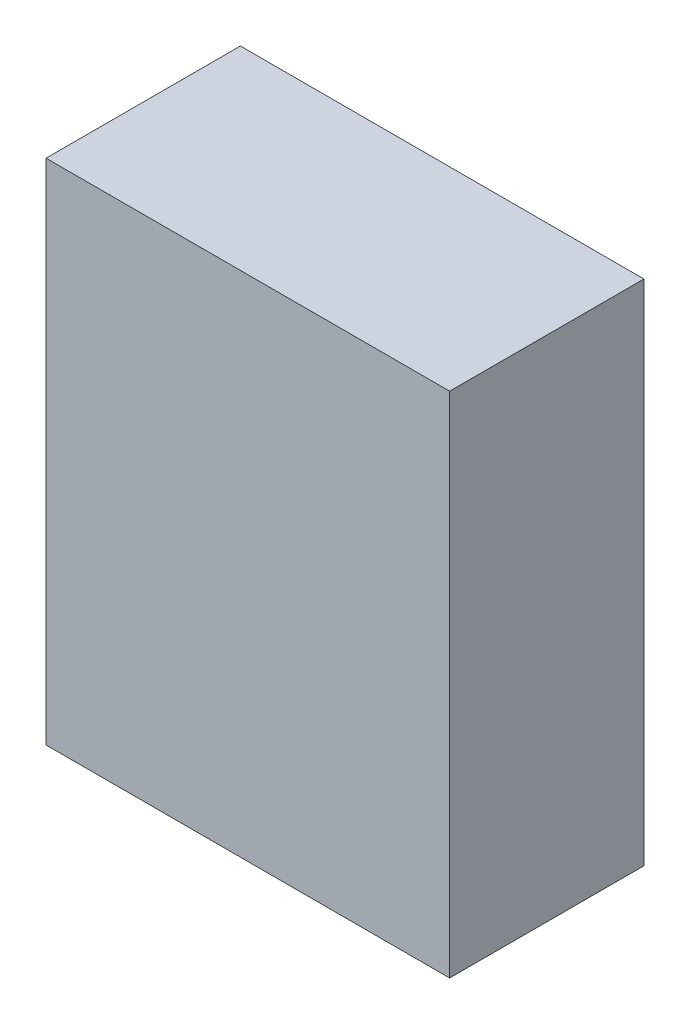
ISO-10303-21;
HEADER;
FILE_DESCRIPTION(('STEP AP214'),'2;1');
FILE_NAME('part.step','',(''),(''),'','','');
FILE_SCHEMA(('AUTOMOTIVE_DESIGN { 1 0 10303 214 1 1 1 1 }'));
ENDSEC;
DATA;
#1=APPLICATION_CONTEXT('core data for automotive mechanical design processes');
#2=APPLICATION_PROTOCOL_DEFINITION('international standard','automotive_design',2000,#1);
#3=PRODUCT_CONTEXT('',#1,'mechanical');
#4=PRODUCT('Part','Part','',(#3));
#5=PRODUCT_RELATED_PRODUCT_CATEGORY('part','',(#4));
#6=PRODUCT_DEFINITION_FORMATION('','',#4);
#7=PRODUCT_DEFINITION_CONTEXT('part definition',#1,'design');
#8=PRODUCT_DEFINITION('design','',#6,#7);
#9=PRODUCT_DEFINITION_SHAPE('','',#8);
#10=(LENGTH_UNIT() NAMED_UNIT(*) SI_UNIT(.MILLI.,.METRE.));
#11=(NAMED_UNIT(*) PLANE_ANGLE_UNIT() SI_UNIT($,.RADIAN.));
#12=(NAMED_UNIT(*) SI_UNIT($,.STERADIAN.) SOLID_ANGLE_UNIT());
#13=UNCERTAINTY_MEASURE_WITH_UNIT(LENGTH_MEASURE(1.E-05),#10,'distance_accuracy_value','');
#14=(GEOMETRIC_REPRESENTATION_CONTEXT(3) GLOBAL_UNCERTAINTY_ASSIGNED_CONTEXT((#13)) GLOBAL_UNIT_ASSIGNED_CONTEXT((#10,
#11,#12)) REPRESENTATION_CONTEXT('',''));
#15=CARTESIAN_POINT('',(0.,0.,0.));
#16=DIRECTION('',(0.,0.,1.));
#17=DIRECTION('',(1.,0.,0.));
#18=AXIS2_PLACEMENT_3D('',#15,#16,#17);
#19=CARTESIAN_POINT('',(-1.34999984,-1.69999914,1.29999994));
#20=DIRECTION('',(0.,0.,1.));
#21=DIRECTION('',(1.,0.,0.));
#22=AXIS2_PLACEMENT_3D('',#19,#20,#21);
#23=PLANE('',#22);
#24=DIRECTION('',(1.,0.,0.));
#25=VECTOR('',#24,1.);
#26=CARTESIAN_POINT('',(-1.34999984,1.69999914,1.29999994));
#27=LINE('',#26,#25);
#28=CARTESIAN_POINT('',(-1.34999984,1.69999914,1.29999994));
#29=VERTEX_POINT('',#28);
#30=CARTESIAN_POINT('',(1.34999984,1.69999914,1.29999994));
#31=VERTEX_POINT('',#30);
#32=EDGE_CURVE('E53',#29,#31,#27,.T.);
#33=ORIENTED_EDGE('',*,*,#32,.F.);
#34=DIRECTION('',(0.,1.,0.));
#35=VECTOR('',#34,1.);
#36=CARTESIAN_POINT('',(-1.34999984,-1.69999914,1.29999994));
#37=LINE('',#36,#35);
#38=CARTESIAN_POINT('',(-1.34999984,-1.69999914,1.29999994));
#39=VERTEX_POINT('',#38);
#40=EDGE_CURVE('E68',#39,#29,#37,.T.);
#41=ORIENTED_EDGE('',*,*,#40,.F.);
#42=DIRECTION('',(1.,0.,0.));
#43=VECTOR('',#42,1.);
#44=CARTESIAN_POINT('',(1.34999984,-1.69999914,1.29999994));
#45=LINE('',#44,#43);
#46=CARTESIAN_POINT('',(1.34999984,-1.69999914,1.29999994));
#47=VERTEX_POINT('',#46);
#48=EDGE_CURVE('E20',#47,#39,#45,.F.);
#49=ORIENTED_EDGE('',*,*,#48,.F.);
#50=DIRECTION('',(0.,1.,0.));
#51=VECTOR('',#50,1.);
#52=CARTESIAN_POINT('',(1.34999984,1.69999914,1.29999994));
#53=LINE('',#52,#51);
#54=EDGE_CURVE('E58',#31,#47,#53,.F.);
#55=ORIENTED_EDGE('',*,*,#54,.F.);
#56=EDGE_LOOP('',(#33,#41,#49,#55));
#57=FACE_BOUND('',#56,.T.);
#58=ADVANCED_FACE('F17',(#57),#23,.T.);
#59=CARTESIAN_POINT('',(1.34999984,-1.69999914,0.));
#60=DIRECTION('',(0.,-1.,0.));
#61=DIRECTION('',(0.,0.,-1.));
#62=AXIS2_PLACEMENT_3D('',#59,#60,#61);
#63=PLANE('',#62);
#64=DIRECTION('',(0.,0.,1.));
#65=VECTOR('',#64,1.);
#66=CARTESIAN_POINT('',(-1.34999984,-1.69999914,0.));
#67=LINE('',#66,#65);
#68=CARTESIAN_POINT('',(-1.34999984,-1.69999914,0.));
#69=VERTEX_POINT('',#68);
#70=EDGE_CURVE('E79',#69,#39,#67,.T.);
#71=ORIENTED_EDGE('',*,*,#70,.F.);
#72=DIRECTION('',(1.,0.,0.));
#73=VECTOR('',#72,1.);
#74=CARTESIAN_POINT('',(-1.34999984,-1.69999914,0.));
#75=LINE('',#74,#73);
#76=CARTESIAN_POINT('',(1.34999984,-1.69999914,0.));
#77=VERTEX_POINT('',#76);
#78=EDGE_CURVE('E74',#69,#77,#75,.T.);
#79=ORIENTED_EDGE('',*,*,#78,.T.);
#80=DIRECTION('',(0.,0.,-1.));
#81=VECTOR('',#80,1.);
#82=CARTESIAN_POINT('',(1.34999984,-1.69999914,0.));
#83=LINE('',#82,#81);
#84=EDGE_CURVE('E63',#47,#77,#83,.T.);
#85=ORIENTED_EDGE('',*,*,#84,.F.);
#86=ORIENTED_EDGE('',*,*,#48,.T.);
#87=EDGE_LOOP('',(#71,#79,#85,#86));
#88=FACE_BOUND('',#87,.T.);
#89=ADVANCED_FACE('F73',(#88),#63,.T.);
#90=CARTESIAN_POINT('',(1.34999984,1.69999914,0.));
#91=DIRECTION('',(1.,0.,0.));
#92=DIRECTION('',(0.,0.,-1.));
#93=AXIS2_PLACEMENT_3D('',#90,#91,#92);
#94=PLANE('',#93);
#95=ORIENTED_EDGE('',*,*,#84,.T.);
#96=DIRECTION('',(0.,1.,0.));
#97=VECTOR('',#96,1.);
#98=CARTESIAN_POINT('',(1.34999984,-1.69999914,0.));
#99=LINE('',#98,#97);
#100=CARTESIAN_POINT('',(1.34999984,1.69999914,0.));
#101=VERTEX_POINT('',#100);
#102=EDGE_CURVE('E84',#77,#101,#99,.T.);
#103=ORIENTED_EDGE('',*,*,#102,.T.);
#104=DIRECTION('',(0.,0.,1.));
#105=VECTOR('',#104,1.);
#106=CARTESIAN_POINT('',(1.34999984,1.69999914,0.));
#107=LINE('',#106,#105);
#108=EDGE_CURVE('E65',#31,#101,#107,.F.);
#109=ORIENTED_EDGE('',*,*,#108,.F.);
#110=ORIENTED_EDGE('',*,*,#54,.T.);
#111=EDGE_LOOP('',(#95,#103,#109,#110));
#112=FACE_BOUND('',#111,.T.);
#113=ADVANCED_FACE('F60',(#112),#94,.T.);
#114=CARTESIAN_POINT('',(-1.34999984,1.69999914,0.));
#115=DIRECTION('',(0.,1.,0.));
#116=DIRECTION('',(0.,0.,1.));
#117=AXIS2_PLACEMENT_3D('',#114,#115,#116);
#118=PLANE('',#117);
#119=ORIENTED_EDGE('',*,*,#108,.T.);
#120=DIRECTION('',(1.,0.,0.));
#121=VECTOR('',#120,1.);
#122=CARTESIAN_POINT('',(-1.34999984,1.69999914,0.));
#123=LINE('',#122,#121);
#124=CARTESIAN_POINT('',(-1.34999984,1.69999914,0.));
#125=VERTEX_POINT('',#124);
#126=EDGE_CURVE('E26',#101,#125,#123,.F.);
#127=ORIENTED_EDGE('',*,*,#126,.T.);
#128=DIRECTION('',(0.,0.,1.));
#129=VECTOR('',#128,1.);
#130=CARTESIAN_POINT('',(-1.34999984,1.69999914,0.));
#131=LINE('',#130,#129);
#132=EDGE_CURVE('E34',#29,#125,#131,.F.);
#133=ORIENTED_EDGE('',*,*,#132,.F.);
#134=ORIENTED_EDGE('',*,*,#32,.T.);
#135=EDGE_LOOP('',(#119,#127,#133,#134));
#136=FACE_BOUND('',#135,.T.);
#137=ADVANCED_FACE('F88',(#136),#118,.T.);
#138=CARTESIAN_POINT('',(-1.34999984,-1.69999914,0.));
#139=DIRECTION('',(-1.,0.,0.));
#140=DIRECTION('',(0.,0.,1.));
#141=AXIS2_PLACEMENT_3D('',#138,#139,#140);
#142=PLANE('',#141);
#143=ORIENTED_EDGE('',*,*,#132,.T.);
#144=DIRECTION('',(0.,1.,0.));
#145=VECTOR('',#144,1.);
#146=CARTESIAN_POINT('',(-1.34999984,-1.69999914,0.));
#147=LINE('',#146,#145);
#148=EDGE_CURVE('E11',#125,#69,#147,.F.);
#149=ORIENTED_EDGE('',*,*,#148,.T.);
#150=ORIENTED_EDGE('',*,*,#70,.T.);
#151=ORIENTED_EDGE('',*,*,#40,.T.);
#152=EDGE_LOOP('',(#143,#149,#150,#151));
#153=FACE_BOUND('',#152,.T.);
#154=ADVANCED_FACE('F91',(#153),#142,.T.);
#155=CARTESIAN_POINT('',(-1.34999984,-1.69999914,0.));
#156=DIRECTION('',(0.,0.,1.));
#157=DIRECTION('',(1.,0.,0.));
#158=AXIS2_PLACEMENT_3D('',#155,#156,#157);
#159=PLANE('',#158);
#160=ORIENTED_EDGE('',*,*,#126,.F.);
#161=ORIENTED_EDGE('',*,*,#102,.F.);
#162=ORIENTED_EDGE('',*,*,#78,.F.);
#163=ORIENTED_EDGE('',*,*,#148,.F.);
#164=EDGE_LOOP('',(#160,#161,#162,#163));
#165=FACE_BOUND('',#164,.T.);
#166=ADVANCED_FACE('F90',(#165),#159,.F.);
#167=CLOSED_SHELL('',(#58,#89,#113,#137,#154,#166));
#168=MANIFOLD_SOLID_BREP('B1',#167);
#169=ADVANCED_BREP_SHAPE_REPRESENTATION('',(#18,#168),#14);
#170=SHAPE_DEFINITION_REPRESENTATION(#9,#169);
ENDSEC;
END-ISO-10303-21;
